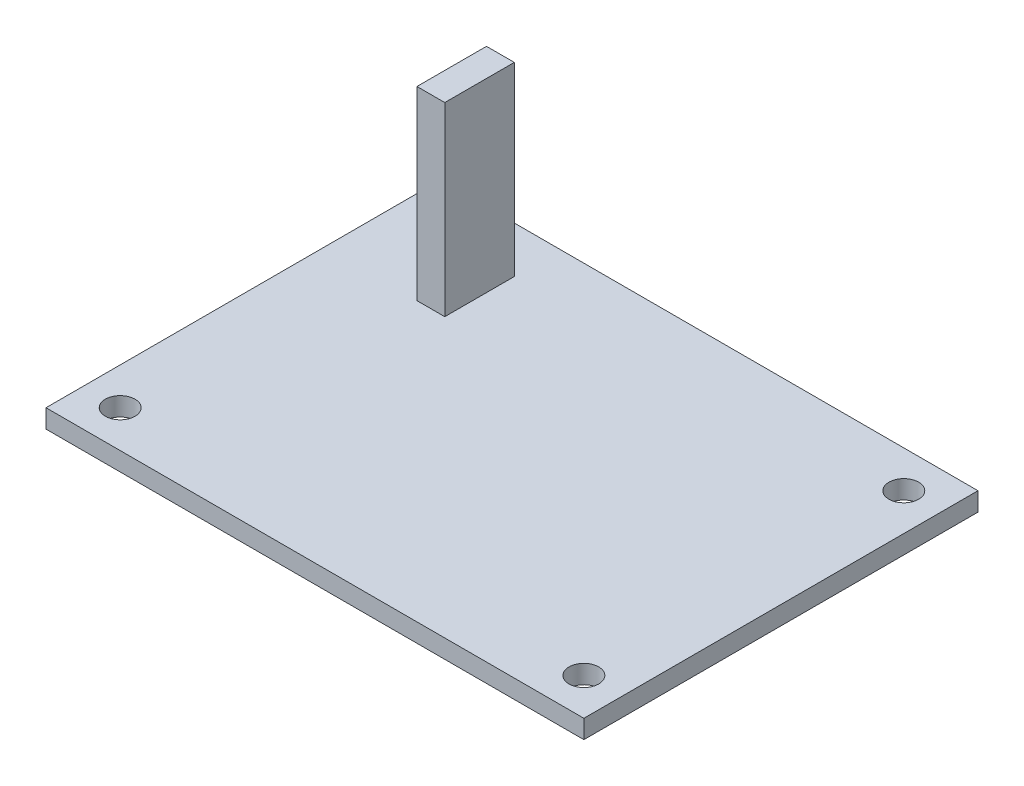
ISO-10303-21;
HEADER;
FILE_DESCRIPTION(('STEP AP214'),'2;1');
FILE_NAME('part.step','',(''),(''),'','','');
FILE_SCHEMA(('AUTOMOTIVE_DESIGN { 1 0 10303 214 1 1 1 1 }'));
ENDSEC;
DATA;
#1=APPLICATION_CONTEXT('core data for automotive mechanical design processes');
#2=APPLICATION_PROTOCOL_DEFINITION('international standard','automotive_design',2000,#1);
#3=PRODUCT_CONTEXT('',#1,'mechanical');
#4=PRODUCT('Part','Part','',(#3));
#5=PRODUCT_RELATED_PRODUCT_CATEGORY('part','',(#4));
#6=PRODUCT_DEFINITION_FORMATION('','',#4);
#7=PRODUCT_DEFINITION_CONTEXT('part definition',#1,'design');
#8=PRODUCT_DEFINITION('design','',#6,#7);
#9=PRODUCT_DEFINITION_SHAPE('','',#8);
#10=(LENGTH_UNIT() NAMED_UNIT(*) SI_UNIT(.MILLI.,.METRE.));
#11=(NAMED_UNIT(*) PLANE_ANGLE_UNIT() SI_UNIT($,.RADIAN.));
#12=(NAMED_UNIT(*) SI_UNIT($,.STERADIAN.) SOLID_ANGLE_UNIT());
#13=UNCERTAINTY_MEASURE_WITH_UNIT(LENGTH_MEASURE(1.E-05),#10,'distance_accuracy_value','');
#14=(GEOMETRIC_REPRESENTATION_CONTEXT(3) GLOBAL_UNCERTAINTY_ASSIGNED_CONTEXT((#13)) GLOBAL_UNIT_ASSIGNED_CONTEXT((#10,
#11,#12)) REPRESENTATION_CONTEXT('',''));
#15=CARTESIAN_POINT('',(0.,0.,0.));
#16=DIRECTION('',(0.,0.,1.));
#17=DIRECTION('',(1.,0.,0.));
#18=AXIS2_PLACEMENT_3D('',#15,#16,#17);
#19=CARTESIAN_POINT('',(0.,2.,0.));
#20=DIRECTION('',(0.,-1.,0.));
#21=DIRECTION('',(0.,0.,-1.));
#22=AXIS2_PLACEMENT_3D('',#19,#20,#21);
#23=PLANE('',#22);
#24=DIRECTION('',(0.,0.,1.));
#25=VECTOR('',#24,1.);
#26=CARTESIAN_POINT('',(0.,2.,0.));
#27=LINE('',#26,#25);
#28=CARTESIAN_POINT('',(0.,2.,-42.5));
#29=VERTEX_POINT('',#28);
#30=CARTESIAN_POINT('',(0.,2.,0.));
#31=VERTEX_POINT('',#30);
#32=EDGE_CURVE('E168',#29,#31,#27,.T.);
#33=ORIENTED_EDGE('',*,*,#32,.T.);
#34=DIRECTION('',(1.,0.,0.));
#35=VECTOR('',#34,1.);
#36=CARTESIAN_POINT('',(0.,2.,0.));
#37=LINE('',#36,#35);
#38=CARTESIAN_POINT('',(58.,2.,0.));
#39=VERTEX_POINT('',#38);
#40=EDGE_CURVE('E172',#31,#39,#37,.T.);
#41=ORIENTED_EDGE('',*,*,#40,.T.);
#42=DIRECTION('',(0.,0.,-1.));
#43=VECTOR('',#42,1.);
#44=CARTESIAN_POINT('',(58.,2.,0.));
#45=LINE('',#44,#43);
#46=CARTESIAN_POINT('',(58.,2.,-42.5));
#47=VERTEX_POINT('',#46);
#48=EDGE_CURVE('E176',#39,#47,#45,.T.);
#49=ORIENTED_EDGE('',*,*,#48,.T.);
#50=DIRECTION('',(-1.,0.,0.));
#51=VECTOR('',#50,1.);
#52=CARTESIAN_POINT('',(0.,2.,-42.5));
#53=LINE('',#52,#51);
#54=EDGE_CURVE('E179',#47,#29,#53,.T.);
#55=ORIENTED_EDGE('',*,*,#54,.T.);
#56=EDGE_LOOP('',(#33,#41,#49,#55));
#57=FACE_BOUND('',#56,.T.);
#58=CARTESIAN_POINT('',(54.,2.,-38.5));
#59=DIRECTION('',(0.,1.,0.));
#60=DIRECTION('',(0.,0.,1.));
#61=AXIS2_PLACEMENT_3D('',#58,#59,#60);
#62=CIRCLE('',#61,1.6);
#63=CARTESIAN_POINT('',(54.,2.,-36.9));
#64=VERTEX_POINT('',#63);
#65=EDGE_CURVE('E144',#64,#64,#62,.T.);
#66=ORIENTED_EDGE('',*,*,#65,.F.);
#67=EDGE_LOOP('',(#66));
#68=FACE_BOUND('',#67,.T.);
#69=CARTESIAN_POINT('',(54.,2.,-4.));
#70=DIRECTION('',(0.,1.,0.));
#71=DIRECTION('',(0.,0.,-1.));
#72=AXIS2_PLACEMENT_3D('',#69,#70,#71);
#73=CIRCLE('',#72,1.6);
#74=CARTESIAN_POINT('',(54.,2.,-5.59999999999999));
#75=VERTEX_POINT('',#74);
#76=EDGE_CURVE('E145',#75,#75,#73,.T.);
#77=ORIENTED_EDGE('',*,*,#76,.F.);
#78=EDGE_LOOP('',(#77));
#79=FACE_BOUND('',#78,.T.);
#80=CARTESIAN_POINT('',(4.00000000000001,2.,-4.));
#81=DIRECTION('',(0.,1.,0.));
#82=DIRECTION('',(0.,0.,1.));
#83=AXIS2_PLACEMENT_3D('',#80,#81,#82);
#84=CIRCLE('',#83,1.6);
#85=CARTESIAN_POINT('',(4.00000000000001,2.,-2.4));
#86=VERTEX_POINT('',#85);
#87=EDGE_CURVE('E153',#86,#86,#84,.T.);
#88=ORIENTED_EDGE('',*,*,#87,.F.);
#89=EDGE_LOOP('',(#88));
#90=FACE_BOUND('',#89,.T.);
#91=CARTESIAN_POINT('',(4.00000000000001,2.,-38.5));
#92=DIRECTION('',(0.,1.,0.));
#93=DIRECTION('',(0.,0.,-1.));
#94=AXIS2_PLACEMENT_3D('',#91,#92,#93);
#95=CIRCLE('',#94,1.6);
#96=CARTESIAN_POINT('',(4.00000000000001,2.,-40.1));
#97=VERTEX_POINT('',#96);
#98=EDGE_CURVE('E129',#97,#97,#95,.T.);
#99=ORIENTED_EDGE('',*,*,#98,.F.);
#100=EDGE_LOOP('',(#99));
#101=FACE_BOUND('',#100,.T.);
#102=DIRECTION('',(0.,0.,1.));
#103=VECTOR('',#102,1.);
#104=CARTESIAN_POINT('',(10.,2.,-37.5));
#105=LINE('',#104,#103);
#106=CARTESIAN_POINT('',(10.,2.,-37.5));
#107=VERTEX_POINT('',#106);
#108=CARTESIAN_POINT('',(10.,2.,-30.));
#109=VERTEX_POINT('',#108);
#110=EDGE_CURVE('E127',#107,#109,#105,.T.);
#111=ORIENTED_EDGE('',*,*,#110,.F.);
#112=DIRECTION('',(-1.,0.,0.));
#113=VECTOR('',#112,1.);
#114=CARTESIAN_POINT('',(10.,2.,-37.5));
#115=LINE('',#114,#113);
#116=CARTESIAN_POINT('',(13.,2.,-37.5));
#117=VERTEX_POINT('',#116);
#118=EDGE_CURVE('E124',#117,#107,#115,.T.);
#119=ORIENTED_EDGE('',*,*,#118,.F.);
#120=DIRECTION('',(0.,0.,-1.));
#121=VECTOR('',#120,1.);
#122=CARTESIAN_POINT('',(13.,2.,-37.5));
#123=LINE('',#122,#121);
#124=CARTESIAN_POINT('',(13.,2.,-30.));
#125=VERTEX_POINT('',#124);
#126=EDGE_CURVE('E60',#125,#117,#123,.T.);
#127=ORIENTED_EDGE('',*,*,#126,.F.);
#128=DIRECTION('',(1.,0.,0.));
#129=VECTOR('',#128,1.);
#130=CARTESIAN_POINT('',(10.,2.,-30.));
#131=LINE('',#130,#129);
#132=EDGE_CURVE('E55',#109,#125,#131,.T.);
#133=ORIENTED_EDGE('',*,*,#132,.F.);
#134=EDGE_LOOP('',(#111,#119,#127,#133));
#135=FACE_BOUND('',#134,.T.);
#136=ADVANCED_FACE('F39',(#57,#68,#79,#90,#101,#135),#23,.F.);
#137=CARTESIAN_POINT('',(0.,2.,0.));
#138=DIRECTION('',(1.,0.,0.));
#139=DIRECTION('',(0.,0.,-1.));
#140=AXIS2_PLACEMENT_3D('',#137,#138,#139);
#141=PLANE('',#140);
#142=DIRECTION('',(0.,0.,1.));
#143=VECTOR('',#142,1.);
#144=CARTESIAN_POINT('',(0.,0.,0.));
#145=LINE('',#144,#143);
#146=CARTESIAN_POINT('',(0.,0.,-42.5));
#147=VERTEX_POINT('',#146);
#148=CARTESIAN_POINT('',(0.,0.,0.));
#149=VERTEX_POINT('',#148);
#150=EDGE_CURVE('E164',#147,#149,#145,.T.);
#151=ORIENTED_EDGE('',*,*,#150,.T.);
#152=DIRECTION('',(0.,-1.,0.));
#153=VECTOR('',#152,1.);
#154=CARTESIAN_POINT('',(0.,2.,0.));
#155=LINE('',#154,#153);
#156=EDGE_CURVE('E11',#31,#149,#155,.T.);
#157=ORIENTED_EDGE('',*,*,#156,.F.);
#158=ORIENTED_EDGE('',*,*,#32,.F.);
#159=DIRECTION('',(0.,-1.,0.));
#160=VECTOR('',#159,1.);
#161=CARTESIAN_POINT('',(0.,2.,-42.5));
#162=LINE('',#161,#160);
#163=EDGE_CURVE('E182',#29,#147,#162,.T.);
#164=ORIENTED_EDGE('',*,*,#163,.T.);
#165=EDGE_LOOP('',(#151,#157,#158,#164));
#166=FACE_BOUND('',#165,.T.);
#167=ADVANCED_FACE('F41',(#166),#141,.F.);
#168=CARTESIAN_POINT('',(0.,2.,0.));
#169=DIRECTION('',(0.,0.,-1.));
#170=DIRECTION('',(-1.,0.,0.));
#171=AXIS2_PLACEMENT_3D('',#168,#169,#170);
#172=PLANE('',#171);
#173=DIRECTION('',(1.,0.,0.));
#174=VECTOR('',#173,1.);
#175=CARTESIAN_POINT('',(0.,0.,0.));
#176=LINE('',#175,#174);
#177=CARTESIAN_POINT('',(58.,0.,0.));
#178=VERTEX_POINT('',#177);
#179=EDGE_CURVE('E186',#149,#178,#176,.T.);
#180=ORIENTED_EDGE('',*,*,#179,.T.);
#181=DIRECTION('',(0.,-1.,0.));
#182=VECTOR('',#181,1.);
#183=CARTESIAN_POINT('',(58.,2.,0.));
#184=LINE('',#183,#182);
#185=EDGE_CURVE('E48',#39,#178,#184,.T.);
#186=ORIENTED_EDGE('',*,*,#185,.F.);
#187=ORIENTED_EDGE('',*,*,#40,.F.);
#188=ORIENTED_EDGE('',*,*,#156,.T.);
#189=EDGE_LOOP('',(#180,#186,#187,#188));
#190=FACE_BOUND('',#189,.T.);
#191=ADVANCED_FACE('F222',(#190),#172,.F.);
#192=CARTESIAN_POINT('',(58.,2.,0.));
#193=DIRECTION('',(-1.,0.,0.));
#194=DIRECTION('',(0.,0.,1.));
#195=AXIS2_PLACEMENT_3D('',#192,#193,#194);
#196=PLANE('',#195);
#197=DIRECTION('',(0.,0.,-1.));
#198=VECTOR('',#197,1.);
#199=CARTESIAN_POINT('',(58.,0.,0.));
#200=LINE('',#199,#198);
#201=CARTESIAN_POINT('',(58.,0.,-42.5));
#202=VERTEX_POINT('',#201);
#203=EDGE_CURVE('E189',#178,#202,#200,.T.);
#204=ORIENTED_EDGE('',*,*,#203,.T.);
#205=DIRECTION('',(0.,-1.,0.));
#206=VECTOR('',#205,1.);
#207=CARTESIAN_POINT('',(58.,2.,-42.5));
#208=LINE('',#207,#206);
#209=EDGE_CURVE('E197',#47,#202,#208,.T.);
#210=ORIENTED_EDGE('',*,*,#209,.F.);
#211=ORIENTED_EDGE('',*,*,#48,.F.);
#212=ORIENTED_EDGE('',*,*,#185,.T.);
#213=EDGE_LOOP('',(#204,#210,#211,#212));
#214=FACE_BOUND('',#213,.T.);
#215=ADVANCED_FACE('F206',(#214),#196,.F.);
#216=CARTESIAN_POINT('',(0.,2.,-42.5));
#217=DIRECTION('',(0.,0.,1.));
#218=DIRECTION('',(1.,0.,0.));
#219=AXIS2_PLACEMENT_3D('',#216,#217,#218);
#220=PLANE('',#219);
#221=DIRECTION('',(-1.,0.,0.));
#222=VECTOR('',#221,1.);
#223=CARTESIAN_POINT('',(0.,0.,-42.5));
#224=LINE('',#223,#222);
#225=EDGE_CURVE('E173',#202,#147,#224,.T.);
#226=ORIENTED_EDGE('',*,*,#225,.T.);
#227=ORIENTED_EDGE('',*,*,#163,.F.);
#228=ORIENTED_EDGE('',*,*,#54,.F.);
#229=ORIENTED_EDGE('',*,*,#209,.T.);
#230=EDGE_LOOP('',(#226,#227,#228,#229));
#231=FACE_BOUND('',#230,.T.);
#232=ADVANCED_FACE('F215',(#231),#220,.F.);
#233=CARTESIAN_POINT('',(0.,0.,0.));
#234=DIRECTION('',(0.,-1.,0.));
#235=DIRECTION('',(0.,0.,-1.));
#236=AXIS2_PLACEMENT_3D('',#233,#234,#235);
#237=PLANE('',#236);
#238=CARTESIAN_POINT('',(4.00000000000001,0.,-38.5));
#239=DIRECTION('',(0.,1.,0.));
#240=DIRECTION('',(0.,0.,-1.));
#241=AXIS2_PLACEMENT_3D('',#238,#239,#240);
#242=CIRCLE('',#241,1.6);
#243=CARTESIAN_POINT('',(4.00000000000001,0.,-40.1));
#244=VERTEX_POINT('',#243);
#245=EDGE_CURVE('E134',#244,#244,#242,.T.);
#246=ORIENTED_EDGE('',*,*,#245,.T.);
#247=EDGE_LOOP('',(#246));
#248=FACE_BOUND('',#247,.T.);
#249=CARTESIAN_POINT('',(4.00000000000001,0.,-4.));
#250=DIRECTION('',(0.,1.,0.));
#251=DIRECTION('',(0.,0.,1.));
#252=AXIS2_PLACEMENT_3D('',#249,#250,#251);
#253=CIRCLE('',#252,1.6);
#254=CARTESIAN_POINT('',(4.00000000000001,0.,-2.4));
#255=VERTEX_POINT('',#254);
#256=EDGE_CURVE('E149',#255,#255,#253,.T.);
#257=ORIENTED_EDGE('',*,*,#256,.T.);
#258=EDGE_LOOP('',(#257));
#259=FACE_BOUND('',#258,.T.);
#260=CARTESIAN_POINT('',(54.,0.,-4.));
#261=DIRECTION('',(0.,1.,0.));
#262=DIRECTION('',(0.,0.,-1.));
#263=AXIS2_PLACEMENT_3D('',#260,#261,#262);
#264=CIRCLE('',#263,1.6);
#265=CARTESIAN_POINT('',(54.,0.,-5.59999999999999));
#266=VERTEX_POINT('',#265);
#267=EDGE_CURVE('E140',#266,#266,#264,.T.);
#268=ORIENTED_EDGE('',*,*,#267,.T.);
#269=EDGE_LOOP('',(#268));
#270=FACE_BOUND('',#269,.T.);
#271=CARTESIAN_POINT('',(54.,0.,-38.5));
#272=DIRECTION('',(0.,1.,0.));
#273=DIRECTION('',(0.,0.,1.));
#274=AXIS2_PLACEMENT_3D('',#271,#272,#273);
#275=CIRCLE('',#274,1.6);
#276=CARTESIAN_POINT('',(54.,0.,-36.9));
#277=VERTEX_POINT('',#276);
#278=EDGE_CURVE('E160',#277,#277,#275,.T.);
#279=ORIENTED_EDGE('',*,*,#278,.T.);
#280=EDGE_LOOP('',(#279));
#281=FACE_BOUND('',#280,.T.);
#282=ORIENTED_EDGE('',*,*,#150,.F.);
#283=ORIENTED_EDGE('',*,*,#225,.F.);
#284=ORIENTED_EDGE('',*,*,#203,.F.);
#285=ORIENTED_EDGE('',*,*,#179,.F.);
#286=EDGE_LOOP('',(#282,#283,#284,#285));
#287=FACE_BOUND('',#286,.T.);
#288=ADVANCED_FACE('F212',(#248,#259,#270,#281,#287),#237,.T.);
#289=CARTESIAN_POINT('',(54.,0.,-38.5));
#290=DIRECTION('',(0.,1.,0.));
#291=DIRECTION('',(0.,0.,1.));
#292=AXIS2_PLACEMENT_3D('',#289,#290,#291);
#293=CYLINDRICAL_SURFACE('',#292,1.6);
#294=ORIENTED_EDGE('',*,*,#278,.F.);
#295=EDGE_LOOP('',(#294));
#296=FACE_BOUND('',#295,.T.);
#297=ORIENTED_EDGE('',*,*,#65,.T.);
#298=EDGE_LOOP('',(#297));
#299=FACE_BOUND('',#298,.T.);
#300=ADVANCED_FACE('F235',(#296,#299),#293,.F.);
#301=CARTESIAN_POINT('',(54.,0.,-4.));
#302=DIRECTION('',(0.,1.,0.));
#303=DIRECTION('',(0.,0.,1.));
#304=AXIS2_PLACEMENT_3D('',#301,#302,#303);
#305=CYLINDRICAL_SURFACE('',#304,1.6);
#306=ORIENTED_EDGE('',*,*,#267,.F.);
#307=EDGE_LOOP('',(#306));
#308=FACE_BOUND('',#307,.T.);
#309=ORIENTED_EDGE('',*,*,#76,.T.);
#310=EDGE_LOOP('',(#309));
#311=FACE_BOUND('',#310,.T.);
#312=ADVANCED_FACE('F255',(#308,#311),#305,.F.);
#313=CARTESIAN_POINT('',(4.00000000000001,0.,-4.));
#314=DIRECTION('',(0.,1.,0.));
#315=DIRECTION('',(0.,0.,1.));
#316=AXIS2_PLACEMENT_3D('',#313,#314,#315);
#317=CYLINDRICAL_SURFACE('',#316,1.6);
#318=ORIENTED_EDGE('',*,*,#256,.F.);
#319=EDGE_LOOP('',(#318));
#320=FACE_BOUND('',#319,.T.);
#321=ORIENTED_EDGE('',*,*,#87,.T.);
#322=EDGE_LOOP('',(#321));
#323=FACE_BOUND('',#322,.T.);
#324=ADVANCED_FACE('F262',(#320,#323),#317,.F.);
#325=CARTESIAN_POINT('',(4.00000000000001,0.,-38.5));
#326=DIRECTION('',(0.,1.,0.));
#327=DIRECTION('',(0.,0.,1.));
#328=AXIS2_PLACEMENT_3D('',#325,#326,#327);
#329=CYLINDRICAL_SURFACE('',#328,1.6);
#330=ORIENTED_EDGE('',*,*,#245,.F.);
#331=EDGE_LOOP('',(#330));
#332=FACE_BOUND('',#331,.T.);
#333=ORIENTED_EDGE('',*,*,#98,.T.);
#334=EDGE_LOOP('',(#333));
#335=FACE_BOUND('',#334,.T.);
#336=ADVANCED_FACE('F270',(#332,#335),#329,.F.);
#337=CARTESIAN_POINT('',(10.,22.,-37.5));
#338=DIRECTION('',(1.,0.,0.));
#339=DIRECTION('',(0.,0.,-1.));
#340=AXIS2_PLACEMENT_3D('',#337,#338,#339);
#341=PLANE('',#340);
#342=ORIENTED_EDGE('',*,*,#110,.T.);
#343=DIRECTION('',(0.,-1.,0.));
#344=VECTOR('',#343,1.);
#345=CARTESIAN_POINT('',(10.,22.,-30.));
#346=LINE('',#345,#344);
#347=CARTESIAN_POINT('',(10.,22.,-30.));
#348=VERTEX_POINT('',#347);
#349=EDGE_CURVE('E106',#348,#109,#346,.T.);
#350=ORIENTED_EDGE('',*,*,#349,.F.);
#351=DIRECTION('',(0.,0.,1.));
#352=VECTOR('',#351,1.);
#353=CARTESIAN_POINT('',(10.,22.,-37.5));
#354=LINE('',#353,#352);
#355=CARTESIAN_POINT('',(10.,22.,-37.5));
#356=VERTEX_POINT('',#355);
#357=EDGE_CURVE('E114',#356,#348,#354,.T.);
#358=ORIENTED_EDGE('',*,*,#357,.F.);
#359=DIRECTION('',(0.,-1.,0.));
#360=VECTOR('',#359,1.);
#361=CARTESIAN_POINT('',(10.,22.,-37.5));
#362=LINE('',#361,#360);
#363=EDGE_CURVE('E356',#356,#107,#362,.T.);
#364=ORIENTED_EDGE('',*,*,#363,.T.);
#365=EDGE_LOOP('',(#342,#350,#358,#364));
#366=FACE_BOUND('',#365,.T.);
#367=ADVANCED_FACE('F126',(#366),#341,.F.);
#368=CARTESIAN_POINT('',(10.,22.,-30.));
#369=DIRECTION('',(0.,0.,-1.));
#370=DIRECTION('',(-1.,0.,0.));
#371=AXIS2_PLACEMENT_3D('',#368,#369,#370);
#372=PLANE('',#371);
#373=ORIENTED_EDGE('',*,*,#132,.T.);
#374=DIRECTION('',(0.,-1.,0.));
#375=VECTOR('',#374,1.);
#376=CARTESIAN_POINT('',(13.,22.,-30.));
#377=LINE('',#376,#375);
#378=CARTESIAN_POINT('',(13.,22.,-30.));
#379=VERTEX_POINT('',#378);
#380=EDGE_CURVE('E109',#379,#125,#377,.T.);
#381=ORIENTED_EDGE('',*,*,#380,.F.);
#382=DIRECTION('',(1.,0.,0.));
#383=VECTOR('',#382,1.);
#384=CARTESIAN_POINT('',(10.,22.,-30.));
#385=LINE('',#384,#383);
#386=EDGE_CURVE('E102',#348,#379,#385,.T.);
#387=ORIENTED_EDGE('',*,*,#386,.F.);
#388=ORIENTED_EDGE('',*,*,#349,.T.);
#389=EDGE_LOOP('',(#373,#381,#387,#388));
#390=FACE_BOUND('',#389,.T.);
#391=ADVANCED_FACE('F104',(#390),#372,.F.);
#392=CARTESIAN_POINT('',(13.,22.,-37.5));
#393=DIRECTION('',(-1.,0.,0.));
#394=DIRECTION('',(0.,0.,1.));
#395=AXIS2_PLACEMENT_3D('',#392,#393,#394);
#396=PLANE('',#395);
#397=ORIENTED_EDGE('',*,*,#126,.T.);
#398=DIRECTION('',(0.,-1.,0.));
#399=VECTOR('',#398,1.);
#400=CARTESIAN_POINT('',(13.,22.,-37.5));
#401=LINE('',#400,#399);
#402=CARTESIAN_POINT('',(13.,22.,-37.5));
#403=VERTEX_POINT('',#402);
#404=EDGE_CURVE('E136',#403,#117,#401,.T.);
#405=ORIENTED_EDGE('',*,*,#404,.F.);
#406=DIRECTION('',(0.,0.,-1.));
#407=VECTOR('',#406,1.);
#408=CARTESIAN_POINT('',(13.,22.,-37.5));
#409=LINE('',#408,#407);
#410=EDGE_CURVE('E113',#379,#403,#409,.T.);
#411=ORIENTED_EDGE('',*,*,#410,.F.);
#412=ORIENTED_EDGE('',*,*,#380,.T.);
#413=EDGE_LOOP('',(#397,#405,#411,#412));
#414=FACE_BOUND('',#413,.T.);
#415=ADVANCED_FACE('F290',(#414),#396,.F.);
#416=CARTESIAN_POINT('',(10.,22.,-37.5));
#417=DIRECTION('',(0.,0.,1.));
#418=DIRECTION('',(1.,0.,0.));
#419=AXIS2_PLACEMENT_3D('',#416,#417,#418);
#420=PLANE('',#419);
#421=ORIENTED_EDGE('',*,*,#118,.T.);
#422=ORIENTED_EDGE('',*,*,#363,.F.);
#423=DIRECTION('',(-1.,0.,0.));
#424=VECTOR('',#423,1.);
#425=CARTESIAN_POINT('',(10.,22.,-37.5));
#426=LINE('',#425,#424);
#427=EDGE_CURVE('E119',#403,#356,#426,.T.);
#428=ORIENTED_EDGE('',*,*,#427,.F.);
#429=ORIENTED_EDGE('',*,*,#404,.T.);
#430=EDGE_LOOP('',(#421,#422,#428,#429));
#431=FACE_BOUND('',#430,.T.);
#432=ADVANCED_FACE('F297',(#431),#420,.F.);
#433=CARTESIAN_POINT('',(0.,22.,0.));
#434=DIRECTION('',(0.,1.,0.));
#435=DIRECTION('',(0.,0.,1.));
#436=AXIS2_PLACEMENT_3D('',#433,#434,#435);
#437=PLANE('',#436);
#438=ORIENTED_EDGE('',*,*,#357,.T.);
#439=ORIENTED_EDGE('',*,*,#386,.T.);
#440=ORIENTED_EDGE('',*,*,#410,.T.);
#441=ORIENTED_EDGE('',*,*,#427,.T.);
#442=EDGE_LOOP('',(#438,#439,#440,#441));
#443=FACE_BOUND('',#442,.T.);
#444=ADVANCED_FACE('F117',(#443),#437,.T.);
#445=CLOSED_SHELL('',(#136,#167,#191,#215,#232,#288,#300,#312,#324,#336,#367,#391,#415,#432,#444));
#446=MANIFOLD_SOLID_BREP('B2',#445);
#447=ADVANCED_BREP_SHAPE_REPRESENTATION('',(#18,#446),#14);
#448=SHAPE_DEFINITION_REPRESENTATION(#9,#447);
ENDSEC;
END-ISO-10303-21;
